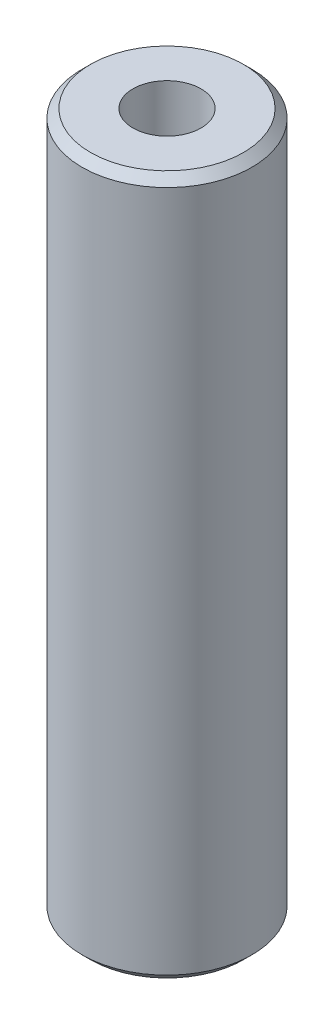
ISO-10303-21;
HEADER;
FILE_DESCRIPTION(('STEP AP214'),'2;1');
FILE_NAME('part.step','',(''),(''),'','','');
FILE_SCHEMA(('AUTOMOTIVE_DESIGN { 1 0 10303 214 1 1 1 1 }'));
ENDSEC;
DATA;
#1=APPLICATION_CONTEXT('core data for automotive mechanical design processes');
#2=APPLICATION_PROTOCOL_DEFINITION('international standard','automotive_design',2000,#1);
#3=PRODUCT_CONTEXT('',#1,'mechanical');
#4=PRODUCT('Part','Part','',(#3));
#5=PRODUCT_RELATED_PRODUCT_CATEGORY('part','',(#4));
#6=PRODUCT_DEFINITION_FORMATION('','',#4);
#7=PRODUCT_DEFINITION_CONTEXT('part definition',#1,'design');
#8=PRODUCT_DEFINITION('design','',#6,#7);
#9=PRODUCT_DEFINITION_SHAPE('','',#8);
#10=(LENGTH_UNIT() NAMED_UNIT(*) SI_UNIT(.MILLI.,.METRE.));
#11=(NAMED_UNIT(*) PLANE_ANGLE_UNIT() SI_UNIT($,.RADIAN.));
#12=(NAMED_UNIT(*) SI_UNIT($,.STERADIAN.) SOLID_ANGLE_UNIT());
#13=UNCERTAINTY_MEASURE_WITH_UNIT(LENGTH_MEASURE(1.E-05),#10,'distance_accuracy_value','');
#14=(GEOMETRIC_REPRESENTATION_CONTEXT(3) GLOBAL_UNCERTAINTY_ASSIGNED_CONTEXT((#13)) GLOBAL_UNIT_ASSIGNED_CONTEXT((#10,
#11,#12)) REPRESENTATION_CONTEXT('',''));
#15=CARTESIAN_POINT('',(0.,0.,0.));
#16=DIRECTION('',(0.,0.,1.));
#17=DIRECTION('',(1.,0.,0.));
#18=AXIS2_PLACEMENT_3D('',#15,#16,#17);
#19=CARTESIAN_POINT('',(0.,329.132771345436,0.));
#20=DIRECTION('',(0.,-1.,0.));
#21=DIRECTION('',(0.,0.,-1.));
#22=AXIS2_PLACEMENT_3D('',#19,#20,#21);
#23=CYLINDRICAL_SURFACE('',#22,40.);
#24=CARTESIAN_POINT('',(0.,325.127677234903,0.));
#25=DIRECTION('',(0.,1.,0.));
#26=DIRECTION('',(0.,0.,1.));
#27=AXIS2_PLACEMENT_3D('',#24,#25,#26);
#28=CIRCLE('',#27,40.);
#29=CARTESIAN_POINT('',(0.,325.127677234903,40.));
#30=VERTEX_POINT('',#29);
#31=EDGE_CURVE('E50',#30,#30,#28,.F.);
#32=ORIENTED_EDGE('',*,*,#31,.T.);
#33=EDGE_LOOP('',(#32));
#34=FACE_BOUND('',#33,.T.);
#35=CARTESIAN_POINT('',(0.,4.00509411053335,0.));
#36=DIRECTION('',(0.,1.,0.));
#37=DIRECTION('',(0.,0.,1.));
#38=AXIS2_PLACEMENT_3D('',#35,#36,#37);
#39=CIRCLE('',#38,40.);
#40=CARTESIAN_POINT('',(0.,4.00509411053335,40.));
#41=VERTEX_POINT('',#40);
#42=EDGE_CURVE('E51',#41,#41,#39,.T.);
#43=ORIENTED_EDGE('',*,*,#42,.T.);
#44=EDGE_LOOP('',(#43));
#45=FACE_BOUND('',#44,.T.);
#46=ADVANCED_FACE('F39',(#34,#45),#23,.T.);
#47=CARTESIAN_POINT('',(0.,329.132771345436,0.));
#48=DIRECTION('',(0.,1.,0.));
#49=DIRECTION('',(0.,0.,1.));
#50=AXIS2_PLACEMENT_3D('',#47,#48,#49);
#51=PLANE('',#50);
#52=CARTESIAN_POINT('',(0.,329.132771345436,0.));
#53=DIRECTION('',(0.,1.,0.));
#54=DIRECTION('',(0.,0.,1.));
#55=AXIS2_PLACEMENT_3D('',#52,#53,#54);
#56=CIRCLE('',#55,35.9949058894666);
#57=CARTESIAN_POINT('',(0.,329.132771345436,35.9949058894666));
#58=VERTEX_POINT('',#57);
#59=EDGE_CURVE('E54',#58,#58,#56,.T.);
#60=ORIENTED_EDGE('',*,*,#59,.T.);
#61=EDGE_LOOP('',(#60));
#62=FACE_BOUND('',#61,.T.);
#63=CARTESIAN_POINT('',(0.,329.132771345436,0.));
#64=DIRECTION('',(0.,1.,0.));
#65=DIRECTION('',(0.,0.,1.));
#66=AXIS2_PLACEMENT_3D('',#63,#64,#65);
#67=CIRCLE('',#66,16.0208006044677);
#68=CARTESIAN_POINT('',(0.,329.132771345436,16.0208006044677));
#69=VERTEX_POINT('',#68);
#70=EDGE_CURVE('E58',#69,#69,#67,.T.);
#71=ORIENTED_EDGE('',*,*,#70,.F.);
#72=EDGE_LOOP('',(#71));
#73=FACE_BOUND('',#72,.T.);
#74=ADVANCED_FACE('F69',(#62,#73),#51,.T.);
#75=CARTESIAN_POINT('',(0.,0.,0.));
#76=DIRECTION('',(0.,1.,0.));
#77=DIRECTION('',(0.,0.,1.));
#78=AXIS2_PLACEMENT_3D('',#75,#76,#77);
#79=PLANE('',#78);
#80=CARTESIAN_POINT('',(0.,0.,0.));
#81=DIRECTION('',(0.,1.,0.));
#82=DIRECTION('',(0.,0.,1.));
#83=AXIS2_PLACEMENT_3D('',#80,#81,#82);
#84=CIRCLE('',#83,35.9949058894667);
#85=CARTESIAN_POINT('',(0.,0.,35.9949058894667));
#86=VERTEX_POINT('',#85);
#87=EDGE_CURVE('E10',#86,#86,#84,.F.);
#88=ORIENTED_EDGE('',*,*,#87,.T.);
#89=EDGE_LOOP('',(#88));
#90=FACE_BOUND('',#89,.T.);
#91=CARTESIAN_POINT('',(0.,0.,0.));
#92=DIRECTION('',(0.,1.,0.));
#93=DIRECTION('',(0.,0.,1.));
#94=AXIS2_PLACEMENT_3D('',#91,#92,#93);
#95=CIRCLE('',#94,16.0208006044677);
#96=CARTESIAN_POINT('',(0.,0.,16.0208006044677));
#97=VERTEX_POINT('',#96);
#98=EDGE_CURVE('E63',#97,#97,#95,.T.);
#99=ORIENTED_EDGE('',*,*,#98,.T.);
#100=EDGE_LOOP('',(#99));
#101=FACE_BOUND('',#100,.T.);
#102=ADVANCED_FACE('F75',(#90,#101),#79,.F.);
#103=CARTESIAN_POINT('',(0.,329.132771345436,0.));
#104=DIRECTION('',(0.,-1.,0.));
#105=DIRECTION('',(0.,0.,-1.));
#106=AXIS2_PLACEMENT_3D('',#103,#104,#105);
#107=CYLINDRICAL_SURFACE('',#106,16.0208006044677);
#108=ORIENTED_EDGE('',*,*,#70,.T.);
#109=EDGE_LOOP('',(#108));
#110=FACE_BOUND('',#109,.T.);
#111=ORIENTED_EDGE('',*,*,#98,.F.);
#112=EDGE_LOOP('',(#111));
#113=FACE_BOUND('',#112,.T.);
#114=ADVANCED_FACE('F70',(#110,#113),#107,.F.);
#115=CARTESIAN_POINT('',(0.,329.132771345436,0.));
#116=DIRECTION('',(0.,-1.,0.));
#117=DIRECTION('',(0.,0.,-1.));
#118=AXIS2_PLACEMENT_3D('',#115,#116,#117);
#119=CONICAL_SURFACE('',#118,35.9949058894666,0.785398163397451);
#120=ORIENTED_EDGE('',*,*,#31,.F.);
#121=EDGE_LOOP('',(#120));
#122=FACE_BOUND('',#121,.T.);
#123=ORIENTED_EDGE('',*,*,#59,.F.);
#124=EDGE_LOOP('',(#123));
#125=FACE_BOUND('',#124,.T.);
#126=ADVANCED_FACE('F81',(#122,#125),#119,.T.);
#127=CARTESIAN_POINT('',(0.,4.00509411053335,0.));
#128=DIRECTION('',(0.,1.,0.));
#129=DIRECTION('',(0.,0.,1.));
#130=AXIS2_PLACEMENT_3D('',#127,#128,#129);
#131=CONICAL_SURFACE('',#130,40.,0.785398163397447);
#132=ORIENTED_EDGE('',*,*,#87,.F.);
#133=EDGE_LOOP('',(#132));
#134=FACE_BOUND('',#133,.T.);
#135=ORIENTED_EDGE('',*,*,#42,.F.);
#136=EDGE_LOOP('',(#135));
#137=FACE_BOUND('',#136,.T.);
#138=ADVANCED_FACE('F45',(#134,#137),#131,.T.);
#139=CLOSED_SHELL('',(#46,#74,#102,#114,#126,#138));
#140=MANIFOLD_SOLID_BREP('B2',#139);
#141=ADVANCED_BREP_SHAPE_REPRESENTATION('',(#18,#140),#14);
#142=SHAPE_DEFINITION_REPRESENTATION(#9,#141);
ENDSEC;
END-ISO-10303-21;
